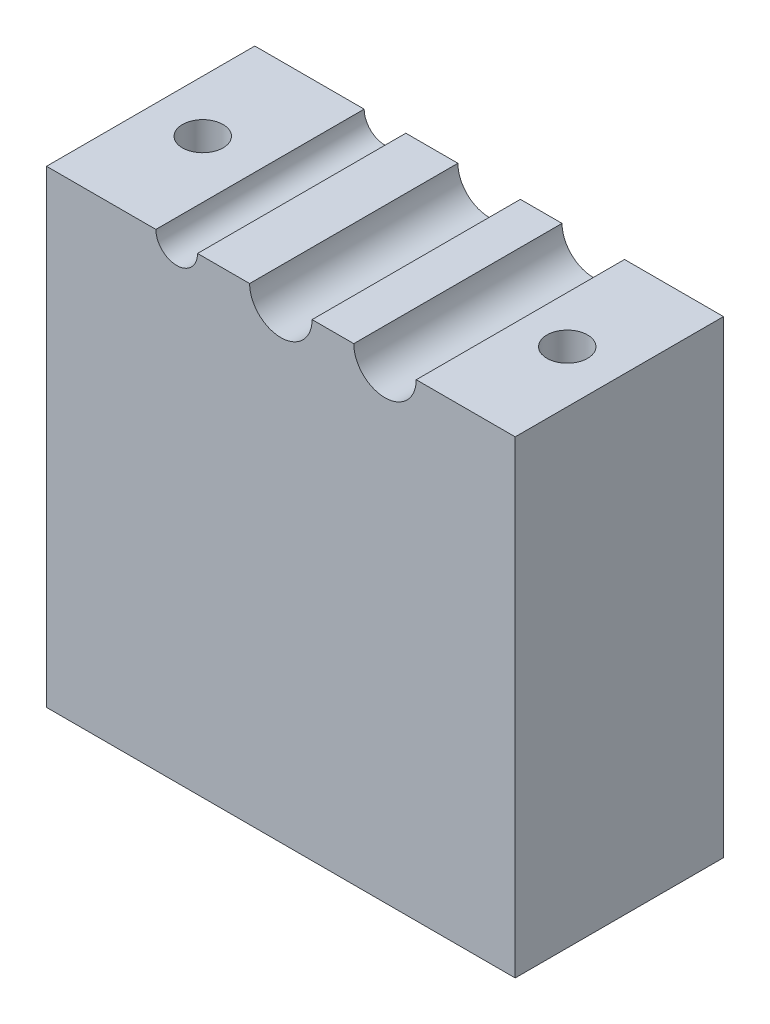
ISO-10303-21;
HEADER;
FILE_DESCRIPTION(('STEP AP214'),'2;1');
FILE_NAME('part.step','',(''),(''),'','','');
FILE_SCHEMA(('AUTOMOTIVE_DESIGN { 1 0 10303 214 1 1 1 1 }'));
ENDSEC;
DATA;
#1=APPLICATION_CONTEXT('core data for automotive mechanical design processes');
#2=APPLICATION_PROTOCOL_DEFINITION('international standard','automotive_design',2000,#1);
#3=PRODUCT_CONTEXT('',#1,'mechanical');
#4=PRODUCT('Part','Part','',(#3));
#5=PRODUCT_RELATED_PRODUCT_CATEGORY('part','',(#4));
#6=PRODUCT_DEFINITION_FORMATION('','',#4);
#7=PRODUCT_DEFINITION_CONTEXT('part definition',#1,'design');
#8=PRODUCT_DEFINITION('design','',#6,#7);
#9=PRODUCT_DEFINITION_SHAPE('','',#8);
#10=(LENGTH_UNIT() NAMED_UNIT(*) SI_UNIT(.MILLI.,.METRE.));
#11=(NAMED_UNIT(*) PLANE_ANGLE_UNIT() SI_UNIT($,.RADIAN.));
#12=(NAMED_UNIT(*) SI_UNIT($,.STERADIAN.) SOLID_ANGLE_UNIT());
#13=UNCERTAINTY_MEASURE_WITH_UNIT(LENGTH_MEASURE(1.E-05),#10,'distance_accuracy_value','');
#14=(GEOMETRIC_REPRESENTATION_CONTEXT(3) GLOBAL_UNCERTAINTY_ASSIGNED_CONTEXT((#13)) GLOBAL_UNIT_ASSIGNED_CONTEXT((#10,
#11,#12)) REPRESENTATION_CONTEXT('',''));
#15=CARTESIAN_POINT('',(0.,0.,0.));
#16=DIRECTION('',(0.,0.,1.));
#17=DIRECTION('',(1.,0.,0.));
#18=AXIS2_PLACEMENT_3D('',#15,#16,#17);
#19=CARTESIAN_POINT('',(13.,22.5,20.));
#20=DIRECTION('',(0.,-1.,0.));
#21=DIRECTION('',(0.,0.,-1.));
#22=AXIS2_PLACEMENT_3D('',#19,#20,#21);
#23=PLANE('',#22);
#24=CARTESIAN_POINT('',(17.5,22.5,10.));
#25=DIRECTION('',(0.,1.,0.));
#26=DIRECTION('',(0.,0.,-1.));
#27=AXIS2_PLACEMENT_3D('',#24,#25,#26);
#28=CIRCLE('',#27,1.95);
#29=CARTESIAN_POINT('',(17.5,22.5,8.05));
#30=VERTEX_POINT('',#29);
#31=EDGE_CURVE('E212',#30,#30,#28,.T.);
#32=ORIENTED_EDGE('',*,*,#31,.F.);
#33=EDGE_LOOP('',(#32));
#34=FACE_BOUND('',#33,.T.);
#35=DIRECTION('',(-1.,0.,0.));
#36=VECTOR('',#35,1.);
#37=CARTESIAN_POINT('',(13.,22.5,0.));
#38=LINE('',#37,#36);
#39=CARTESIAN_POINT('',(22.5,22.5,0.));
#40=VERTEX_POINT('',#39);
#41=CARTESIAN_POINT('',(13.,22.5,0.));
#42=VERTEX_POINT('',#41);
#43=EDGE_CURVE('E146',#40,#42,#38,.T.);
#44=ORIENTED_EDGE('',*,*,#43,.T.);
#45=DIRECTION('',(0.,0.,-1.));
#46=VECTOR('',#45,1.);
#47=CARTESIAN_POINT('',(13.,22.5,20.));
#48=LINE('',#47,#46);
#49=CARTESIAN_POINT('',(13.,22.5,20.));
#50=VERTEX_POINT('',#49);
#51=EDGE_CURVE('E11',#50,#42,#48,.T.);
#52=ORIENTED_EDGE('',*,*,#51,.F.);
#53=DIRECTION('',(-1.,0.,0.));
#54=VECTOR('',#53,1.);
#55=CARTESIAN_POINT('',(13.,22.5,20.));
#56=LINE('',#55,#54);
#57=CARTESIAN_POINT('',(22.5,22.5,20.));
#58=VERTEX_POINT('',#57);
#59=EDGE_CURVE('E165',#58,#50,#56,.T.);
#60=ORIENTED_EDGE('',*,*,#59,.F.);
#61=DIRECTION('',(0.,0.,-1.));
#62=VECTOR('',#61,1.);
#63=CARTESIAN_POINT('',(22.5,22.5,20.));
#64=LINE('',#63,#62);
#65=EDGE_CURVE('E142',#58,#40,#64,.T.);
#66=ORIENTED_EDGE('',*,*,#65,.T.);
#67=EDGE_LOOP('',(#44,#52,#60,#66));
#68=FACE_BOUND('',#67,.T.);
#69=ADVANCED_FACE('F38',(#34,#68),#23,.F.);
#70=CARTESIAN_POINT('',(10.,22.5,20.));
#71=DIRECTION('',(0.,0.,-1.));
#72=DIRECTION('',(-1.,0.,0.));
#73=AXIS2_PLACEMENT_3D('',#70,#71,#72);
#74=CYLINDRICAL_SURFACE('',#73,3.);
#75=CARTESIAN_POINT('',(10.,22.5,0.));
#76=DIRECTION('',(0.,0.,-1.));
#77=DIRECTION('',(1.,0.,0.));
#78=AXIS2_PLACEMENT_3D('',#75,#76,#77);
#79=CIRCLE('',#78,3.);
#80=CARTESIAN_POINT('',(7.,22.5,0.));
#81=VERTEX_POINT('',#80);
#82=EDGE_CURVE('E149',#42,#81,#79,.T.);
#83=ORIENTED_EDGE('',*,*,#82,.T.);
#84=DIRECTION('',(0.,0.,-1.));
#85=VECTOR('',#84,1.);
#86=CARTESIAN_POINT('',(7.,22.5,20.));
#87=LINE('',#86,#85);
#88=CARTESIAN_POINT('',(7.,22.5,20.));
#89=VERTEX_POINT('',#88);
#90=EDGE_CURVE('E46',#89,#81,#87,.T.);
#91=ORIENTED_EDGE('',*,*,#90,.F.);
#92=CARTESIAN_POINT('',(10.,22.5,20.));
#93=DIRECTION('',(0.,0.,-1.));
#94=DIRECTION('',(1.,0.,0.));
#95=AXIS2_PLACEMENT_3D('',#92,#93,#94);
#96=CIRCLE('',#95,3.);
#97=EDGE_CURVE('E103',#50,#89,#96,.T.);
#98=ORIENTED_EDGE('',*,*,#97,.F.);
#99=ORIENTED_EDGE('',*,*,#51,.T.);
#100=EDGE_LOOP('',(#83,#91,#98,#99));
#101=FACE_BOUND('',#100,.T.);
#102=ADVANCED_FACE('F253',(#101),#74,.F.);
#103=CARTESIAN_POINT('',(3.,22.5,20.));
#104=DIRECTION('',(0.,-1.,0.));
#105=DIRECTION('',(0.,0.,-1.));
#106=AXIS2_PLACEMENT_3D('',#103,#104,#105);
#107=PLANE('',#106);
#108=DIRECTION('',(-1.,0.,0.));
#109=VECTOR('',#108,1.);
#110=CARTESIAN_POINT('',(3.,22.5,0.));
#111=LINE('',#110,#109);
#112=CARTESIAN_POINT('',(3.,22.5,0.));
#113=VERTEX_POINT('',#112);
#114=EDGE_CURVE('E152',#81,#113,#111,.T.);
#115=ORIENTED_EDGE('',*,*,#114,.T.);
#116=DIRECTION('',(0.,0.,-1.));
#117=VECTOR('',#116,1.);
#118=CARTESIAN_POINT('',(3.,22.5,20.));
#119=LINE('',#118,#117);
#120=CARTESIAN_POINT('',(3.,22.5,20.));
#121=VERTEX_POINT('',#120);
#122=EDGE_CURVE('E178',#121,#113,#119,.T.);
#123=ORIENTED_EDGE('',*,*,#122,.F.);
#124=DIRECTION('',(-1.,0.,0.));
#125=VECTOR('',#124,1.);
#126=CARTESIAN_POINT('',(3.,22.5,20.));
#127=LINE('',#126,#125);
#128=EDGE_CURVE('E186',#89,#121,#127,.T.);
#129=ORIENTED_EDGE('',*,*,#128,.F.);
#130=ORIENTED_EDGE('',*,*,#90,.T.);
#131=EDGE_LOOP('',(#115,#123,#129,#130));
#132=FACE_BOUND('',#131,.T.);
#133=ADVANCED_FACE('F184',(#132),#107,.F.);
#134=CARTESIAN_POINT('',(0.,22.5,20.));
#135=DIRECTION('',(0.,0.,-1.));
#136=DIRECTION('',(-1.,0.,0.));
#137=AXIS2_PLACEMENT_3D('',#134,#135,#136);
#138=CYLINDRICAL_SURFACE('',#137,3.);
#139=CARTESIAN_POINT('',(0.,22.5,0.));
#140=DIRECTION('',(0.,0.,-1.));
#141=DIRECTION('',(1.,0.,0.));
#142=AXIS2_PLACEMENT_3D('',#139,#140,#141);
#143=CIRCLE('',#142,3.);
#144=CARTESIAN_POINT('',(-3.,22.5,0.));
#145=VERTEX_POINT('',#144);
#146=EDGE_CURVE('E154',#113,#145,#143,.T.);
#147=ORIENTED_EDGE('',*,*,#146,.T.);
#148=DIRECTION('',(0.,0.,-1.));
#149=VECTOR('',#148,1.);
#150=CARTESIAN_POINT('',(-3.,22.5,20.));
#151=LINE('',#150,#149);
#152=CARTESIAN_POINT('',(-3.,22.5,20.));
#153=VERTEX_POINT('',#152);
#154=EDGE_CURVE('E175',#153,#145,#151,.T.);
#155=ORIENTED_EDGE('',*,*,#154,.F.);
#156=CARTESIAN_POINT('',(0.,22.5,20.));
#157=DIRECTION('',(0.,0.,-1.));
#158=DIRECTION('',(1.,0.,0.));
#159=AXIS2_PLACEMENT_3D('',#156,#157,#158);
#160=CIRCLE('',#159,3.);
#161=EDGE_CURVE('E204',#121,#153,#160,.T.);
#162=ORIENTED_EDGE('',*,*,#161,.F.);
#163=ORIENTED_EDGE('',*,*,#122,.T.);
#164=EDGE_LOOP('',(#147,#155,#162,#163));
#165=FACE_BOUND('',#164,.T.);
#166=ADVANCED_FACE('F195',(#165),#138,.F.);
#167=CARTESIAN_POINT('',(-8.,22.5,20.));
#168=DIRECTION('',(0.,-1.,0.));
#169=DIRECTION('',(0.,0.,-1.));
#170=AXIS2_PLACEMENT_3D('',#167,#168,#169);
#171=PLANE('',#170);
#172=DIRECTION('',(-1.,0.,0.));
#173=VECTOR('',#172,1.);
#174=CARTESIAN_POINT('',(-8.,22.5,0.));
#175=LINE('',#174,#173);
#176=CARTESIAN_POINT('',(-8.,22.5,0.));
#177=VERTEX_POINT('',#176);
#178=EDGE_CURVE('E156',#145,#177,#175,.T.);
#179=ORIENTED_EDGE('',*,*,#178,.T.);
#180=DIRECTION('',(0.,0.,-1.));
#181=VECTOR('',#180,1.);
#182=CARTESIAN_POINT('',(-8.,22.5,20.));
#183=LINE('',#182,#181);
#184=CARTESIAN_POINT('',(-8.,22.5,20.));
#185=VERTEX_POINT('',#184);
#186=EDGE_CURVE('E172',#185,#177,#183,.T.);
#187=ORIENTED_EDGE('',*,*,#186,.F.);
#188=DIRECTION('',(-1.,0.,0.));
#189=VECTOR('',#188,1.);
#190=CARTESIAN_POINT('',(-8.,22.5,20.));
#191=LINE('',#190,#189);
#192=EDGE_CURVE('E201',#153,#185,#191,.T.);
#193=ORIENTED_EDGE('',*,*,#192,.F.);
#194=ORIENTED_EDGE('',*,*,#154,.T.);
#195=EDGE_LOOP('',(#179,#187,#193,#194));
#196=FACE_BOUND('',#195,.T.);
#197=ADVANCED_FACE('F199',(#196),#171,.F.);
#198=CARTESIAN_POINT('',(-10.,22.5,20.));
#199=DIRECTION('',(0.,0.,-1.));
#200=DIRECTION('',(-1.,0.,0.));
#201=AXIS2_PLACEMENT_3D('',#198,#199,#200);
#202=CYLINDRICAL_SURFACE('',#201,2.);
#203=CARTESIAN_POINT('',(-10.,22.5,0.));
#204=DIRECTION('',(0.,0.,-1.));
#205=DIRECTION('',(1.,0.,0.));
#206=AXIS2_PLACEMENT_3D('',#203,#204,#205);
#207=CIRCLE('',#206,2.);
#208=CARTESIAN_POINT('',(-12.,22.5,0.));
#209=VERTEX_POINT('',#208);
#210=EDGE_CURVE('E158',#177,#209,#207,.T.);
#211=ORIENTED_EDGE('',*,*,#210,.T.);
#212=DIRECTION('',(0.,0.,-1.));
#213=VECTOR('',#212,1.);
#214=CARTESIAN_POINT('',(-12.,22.5,20.));
#215=LINE('',#214,#213);
#216=CARTESIAN_POINT('',(-12.,22.5,20.));
#217=VERTEX_POINT('',#216);
#218=EDGE_CURVE('E169',#217,#209,#215,.T.);
#219=ORIENTED_EDGE('',*,*,#218,.F.);
#220=CARTESIAN_POINT('',(-10.,22.5,20.));
#221=DIRECTION('',(0.,0.,-1.));
#222=DIRECTION('',(1.,0.,0.));
#223=AXIS2_PLACEMENT_3D('',#220,#221,#222);
#224=CIRCLE('',#223,2.);
#225=EDGE_CURVE('E203',#185,#217,#224,.T.);
#226=ORIENTED_EDGE('',*,*,#225,.F.);
#227=ORIENTED_EDGE('',*,*,#186,.T.);
#228=EDGE_LOOP('',(#211,#219,#226,#227));
#229=FACE_BOUND('',#228,.T.);
#230=ADVANCED_FACE('F235',(#229),#202,.F.);
#231=CARTESIAN_POINT('',(-22.5,22.5,20.));
#232=DIRECTION('',(0.,-1.,0.));
#233=DIRECTION('',(0.,0.,-1.));
#234=AXIS2_PLACEMENT_3D('',#231,#232,#233);
#235=PLANE('',#234);
#236=CARTESIAN_POINT('',(-17.5,22.5,10.));
#237=DIRECTION('',(0.,1.,0.));
#238=DIRECTION('',(0.,0.,1.));
#239=AXIS2_PLACEMENT_3D('',#236,#237,#238);
#240=CIRCLE('',#239,1.95);
#241=CARTESIAN_POINT('',(-17.5,22.5,11.95));
#242=VERTEX_POINT('',#241);
#243=EDGE_CURVE('E218',#242,#242,#240,.T.);
#244=ORIENTED_EDGE('',*,*,#243,.F.);
#245=EDGE_LOOP('',(#244));
#246=FACE_BOUND('',#245,.T.);
#247=DIRECTION('',(-1.,0.,0.));
#248=VECTOR('',#247,1.);
#249=CARTESIAN_POINT('',(-22.5,22.5,0.));
#250=LINE('',#249,#248);
#251=CARTESIAN_POINT('',(-22.5,22.5,0.));
#252=VERTEX_POINT('',#251);
#253=EDGE_CURVE('E160',#209,#252,#250,.T.);
#254=ORIENTED_EDGE('',*,*,#253,.T.);
#255=DIRECTION('',(0.,0.,-1.));
#256=VECTOR('',#255,1.);
#257=CARTESIAN_POINT('',(-22.5,22.5,20.));
#258=LINE('',#257,#256);
#259=CARTESIAN_POINT('',(-22.5,22.5,20.));
#260=VERTEX_POINT('',#259);
#261=EDGE_CURVE('E137',#260,#252,#258,.T.);
#262=ORIENTED_EDGE('',*,*,#261,.F.);
#263=DIRECTION('',(-1.,0.,0.));
#264=VECTOR('',#263,1.);
#265=CARTESIAN_POINT('',(-22.5,22.5,20.));
#266=LINE('',#265,#264);
#267=EDGE_CURVE('E128',#217,#260,#266,.T.);
#268=ORIENTED_EDGE('',*,*,#267,.F.);
#269=ORIENTED_EDGE('',*,*,#218,.T.);
#270=EDGE_LOOP('',(#254,#262,#268,#269));
#271=FACE_BOUND('',#270,.T.);
#272=ADVANCED_FACE('F232',(#246,#271),#235,.F.);
#273=CARTESIAN_POINT('',(-22.5,-22.5,20.));
#274=DIRECTION('',(1.,0.,0.));
#275=DIRECTION('',(0.,0.,-1.));
#276=AXIS2_PLACEMENT_3D('',#273,#274,#275);
#277=PLANE('',#276);
#278=DIRECTION('',(0.,-1.,0.));
#279=VECTOR('',#278,1.);
#280=CARTESIAN_POINT('',(-22.5,-22.5,0.));
#281=LINE('',#280,#279);
#282=CARTESIAN_POINT('',(-22.5,-22.5,0.));
#283=VERTEX_POINT('',#282);
#284=EDGE_CURVE('E136',#252,#283,#281,.T.);
#285=ORIENTED_EDGE('',*,*,#284,.T.);
#286=DIRECTION('',(0.,0.,-1.));
#287=VECTOR('',#286,1.);
#288=CARTESIAN_POINT('',(-22.5,-22.5,20.));
#289=LINE('',#288,#287);
#290=CARTESIAN_POINT('',(-22.5,-22.5,20.));
#291=VERTEX_POINT('',#290);
#292=EDGE_CURVE('E133',#291,#283,#289,.T.);
#293=ORIENTED_EDGE('',*,*,#292,.F.);
#294=DIRECTION('',(0.,-1.,0.));
#295=VECTOR('',#294,1.);
#296=CARTESIAN_POINT('',(-22.5,-22.5,20.));
#297=LINE('',#296,#295);
#298=EDGE_CURVE('E122',#260,#291,#297,.T.);
#299=ORIENTED_EDGE('',*,*,#298,.F.);
#300=ORIENTED_EDGE('',*,*,#261,.T.);
#301=EDGE_LOOP('',(#285,#293,#299,#300));
#302=FACE_BOUND('',#301,.T.);
#303=ADVANCED_FACE('F134',(#302),#277,.F.);
#304=CARTESIAN_POINT('',(-22.5,-22.5,20.));
#305=DIRECTION('',(0.,1.,0.));
#306=DIRECTION('',(0.,0.,1.));
#307=AXIS2_PLACEMENT_3D('',#304,#305,#306);
#308=PLANE('',#307);
#309=DIRECTION('',(1.,0.,0.));
#310=VECTOR('',#309,1.);
#311=CARTESIAN_POINT('',(-22.5,-22.5,0.));
#312=LINE('',#311,#310);
#313=CARTESIAN_POINT('',(22.5,-22.5,0.));
#314=VERTEX_POINT('',#313);
#315=EDGE_CURVE('E89',#283,#314,#312,.T.);
#316=ORIENTED_EDGE('',*,*,#315,.T.);
#317=DIRECTION('',(0.,0.,-1.));
#318=VECTOR('',#317,1.);
#319=CARTESIAN_POINT('',(22.5,-22.5,20.));
#320=LINE('',#319,#318);
#321=CARTESIAN_POINT('',(22.5,-22.5,20.));
#322=VERTEX_POINT('',#321);
#323=EDGE_CURVE('E138',#322,#314,#320,.T.);
#324=ORIENTED_EDGE('',*,*,#323,.F.);
#325=DIRECTION('',(1.,0.,0.));
#326=VECTOR('',#325,1.);
#327=CARTESIAN_POINT('',(-22.5,-22.5,20.));
#328=LINE('',#327,#326);
#329=EDGE_CURVE('E126',#291,#322,#328,.T.);
#330=ORIENTED_EDGE('',*,*,#329,.F.);
#331=ORIENTED_EDGE('',*,*,#292,.T.);
#332=EDGE_LOOP('',(#316,#324,#330,#331));
#333=FACE_BOUND('',#332,.T.);
#334=ADVANCED_FACE('F140',(#333),#308,.F.);
#335=CARTESIAN_POINT('',(22.5,-22.5,20.));
#336=DIRECTION('',(-1.,0.,0.));
#337=DIRECTION('',(0.,0.,1.));
#338=AXIS2_PLACEMENT_3D('',#335,#336,#337);
#339=PLANE('',#338);
#340=DIRECTION('',(0.,1.,0.));
#341=VECTOR('',#340,1.);
#342=CARTESIAN_POINT('',(22.5,-22.5,0.));
#343=LINE('',#342,#341);
#344=EDGE_CURVE('E95',#314,#40,#343,.T.);
#345=ORIENTED_EDGE('',*,*,#344,.T.);
#346=ORIENTED_EDGE('',*,*,#65,.F.);
#347=DIRECTION('',(0.,1.,0.));
#348=VECTOR('',#347,1.);
#349=CARTESIAN_POINT('',(22.5,-22.5,20.));
#350=LINE('',#349,#348);
#351=EDGE_CURVE('E54',#322,#58,#350,.T.);
#352=ORIENTED_EDGE('',*,*,#351,.F.);
#353=ORIENTED_EDGE('',*,*,#323,.T.);
#354=EDGE_LOOP('',(#345,#346,#352,#353));
#355=FACE_BOUND('',#354,.T.);
#356=ADVANCED_FACE('F242',(#355),#339,.F.);
#357=CARTESIAN_POINT('',(-10.,22.5,20.));
#358=DIRECTION('',(0.,0.,1.));
#359=DIRECTION('',(1.,0.,0.));
#360=AXIS2_PLACEMENT_3D('',#357,#358,#359);
#361=PLANE('',#360);
#362=ORIENTED_EDGE('',*,*,#59,.T.);
#363=ORIENTED_EDGE('',*,*,#97,.T.);
#364=ORIENTED_EDGE('',*,*,#128,.T.);
#365=ORIENTED_EDGE('',*,*,#161,.T.);
#366=ORIENTED_EDGE('',*,*,#192,.T.);
#367=ORIENTED_EDGE('',*,*,#225,.T.);
#368=ORIENTED_EDGE('',*,*,#267,.T.);
#369=ORIENTED_EDGE('',*,*,#298,.T.);
#370=ORIENTED_EDGE('',*,*,#329,.T.);
#371=ORIENTED_EDGE('',*,*,#351,.T.);
#372=EDGE_LOOP('',(#362,#363,#364,#365,#366,#367,#368,#369,#370,#371));
#373=FACE_BOUND('',#372,.T.);
#374=ADVANCED_FACE('F124',(#373),#361,.T.);
#375=CARTESIAN_POINT('',(-10.,22.5,0.));
#376=DIRECTION('',(0.,0.,1.));
#377=DIRECTION('',(1.,0.,0.));
#378=AXIS2_PLACEMENT_3D('',#375,#376,#377);
#379=PLANE('',#378);
#380=ORIENTED_EDGE('',*,*,#43,.F.);
#381=ORIENTED_EDGE('',*,*,#344,.F.);
#382=ORIENTED_EDGE('',*,*,#315,.F.);
#383=ORIENTED_EDGE('',*,*,#284,.F.);
#384=ORIENTED_EDGE('',*,*,#253,.F.);
#385=ORIENTED_EDGE('',*,*,#210,.F.);
#386=ORIENTED_EDGE('',*,*,#178,.F.);
#387=ORIENTED_EDGE('',*,*,#146,.F.);
#388=ORIENTED_EDGE('',*,*,#114,.F.);
#389=ORIENTED_EDGE('',*,*,#82,.F.);
#390=EDGE_LOOP('',(#380,#381,#382,#383,#384,#385,#386,#387,#388,#389));
#391=FACE_BOUND('',#390,.T.);
#392=ADVANCED_FACE('F190',(#391),#379,.F.);
#393=CARTESIAN_POINT('',(-17.5,2.5,10.));
#394=DIRECTION('',(0.,1.,0.));
#395=DIRECTION('',(0.,0.,1.));
#396=AXIS2_PLACEMENT_3D('',#393,#394,#395);
#397=CYLINDRICAL_SURFACE('',#396,1.95);
#398=CARTESIAN_POINT('',(-17.5,2.5,10.));
#399=DIRECTION('',(0.,1.,0.));
#400=DIRECTION('',(0.,0.,1.));
#401=AXIS2_PLACEMENT_3D('',#398,#399,#400);
#402=CIRCLE('',#401,1.95);
#403=CARTESIAN_POINT('',(-17.5,2.5,11.95));
#404=VERTEX_POINT('',#403);
#405=EDGE_CURVE('E150',#404,#404,#402,.T.);
#406=ORIENTED_EDGE('',*,*,#405,.F.);
#407=EDGE_LOOP('',(#406));
#408=FACE_BOUND('',#407,.T.);
#409=ORIENTED_EDGE('',*,*,#243,.T.);
#410=EDGE_LOOP('',(#409));
#411=FACE_BOUND('',#410,.T.);
#412=ADVANCED_FACE('F226',(#408,#411),#397,.F.);
#413=CARTESIAN_POINT('',(-17.5,2.5,10.));
#414=DIRECTION('',(0.,1.,0.));
#415=DIRECTION('',(0.,0.,1.));
#416=AXIS2_PLACEMENT_3D('',#413,#414,#415);
#417=PLANE('',#416);
#418=ORIENTED_EDGE('',*,*,#405,.T.);
#419=EDGE_LOOP('',(#418));
#420=FACE_BOUND('',#419,.T.);
#421=ADVANCED_FACE('F224',(#420),#417,.T.);
#422=CARTESIAN_POINT('',(17.5,2.5,10.));
#423=DIRECTION('',(0.,1.,0.));
#424=DIRECTION('',(0.,0.,1.));
#425=AXIS2_PLACEMENT_3D('',#422,#423,#424);
#426=CYLINDRICAL_SURFACE('',#425,1.95);
#427=CARTESIAN_POINT('',(17.5,2.5,10.));
#428=DIRECTION('',(0.,1.,0.));
#429=DIRECTION('',(0.,0.,-1.));
#430=AXIS2_PLACEMENT_3D('',#427,#428,#429);
#431=CIRCLE('',#430,1.95);
#432=CARTESIAN_POINT('',(17.5,2.5,8.05));
#433=VERTEX_POINT('',#432);
#434=EDGE_CURVE('E215',#433,#433,#431,.T.);
#435=ORIENTED_EDGE('',*,*,#434,.F.);
#436=EDGE_LOOP('',(#435));
#437=FACE_BOUND('',#436,.T.);
#438=ORIENTED_EDGE('',*,*,#31,.T.);
#439=EDGE_LOOP('',(#438));
#440=FACE_BOUND('',#439,.T.);
#441=ADVANCED_FACE('F260',(#437,#440),#426,.F.);
#442=CARTESIAN_POINT('',(17.5,2.5,10.));
#443=DIRECTION('',(0.,-1.,0.));
#444=DIRECTION('',(0.,0.,-1.));
#445=AXIS2_PLACEMENT_3D('',#442,#443,#444);
#446=PLANE('',#445);
#447=ORIENTED_EDGE('',*,*,#434,.T.);
#448=EDGE_LOOP('',(#447));
#449=FACE_BOUND('',#448,.T.);
#450=ADVANCED_FACE('F262',(#449),#446,.F.);
#451=CLOSED_SHELL('',(#69,#102,#133,#166,#197,#230,#272,#303,#334,#356,#374,#392,#412,#421,#441,#450));
#452=MANIFOLD_SOLID_BREP('B2',#451);
#453=ADVANCED_BREP_SHAPE_REPRESENTATION('',(#18,#452),#14);
#454=SHAPE_DEFINITION_REPRESENTATION(#9,#453);
ENDSEC;
END-ISO-10303-21;
